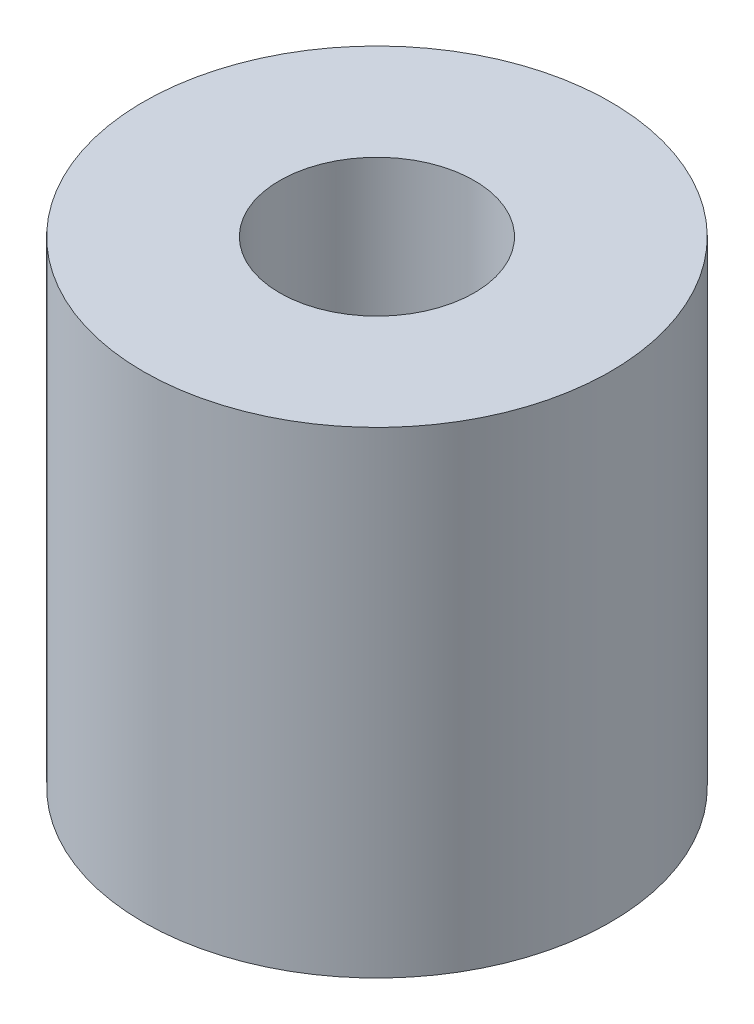
ISO-10303-21;
HEADER;
FILE_DESCRIPTION(('STEP AP214'),'2;1');
FILE_NAME('part.step','',(''),(''),'','','');
FILE_SCHEMA(('AUTOMOTIVE_DESIGN { 1 0 10303 214 1 1 1 1 }'));
ENDSEC;
DATA;
#1=APPLICATION_CONTEXT('core data for automotive mechanical design processes');
#2=APPLICATION_PROTOCOL_DEFINITION('international standard','automotive_design',2000,#1);
#3=PRODUCT_CONTEXT('',#1,'mechanical');
#4=PRODUCT('Part','Part','',(#3));
#5=PRODUCT_RELATED_PRODUCT_CATEGORY('part','',(#4));
#6=PRODUCT_DEFINITION_FORMATION('','',#4);
#7=PRODUCT_DEFINITION_CONTEXT('part definition',#1,'design');
#8=PRODUCT_DEFINITION('design','',#6,#7);
#9=PRODUCT_DEFINITION_SHAPE('','',#8);
#10=(LENGTH_UNIT() NAMED_UNIT(*) SI_UNIT(.MILLI.,.METRE.));
#11=(NAMED_UNIT(*) PLANE_ANGLE_UNIT() SI_UNIT($,.RADIAN.));
#12=(NAMED_UNIT(*) SI_UNIT($,.STERADIAN.) SOLID_ANGLE_UNIT());
#13=UNCERTAINTY_MEASURE_WITH_UNIT(LENGTH_MEASURE(1.E-05),#10,'distance_accuracy_value','');
#14=(GEOMETRIC_REPRESENTATION_CONTEXT(3) GLOBAL_UNCERTAINTY_ASSIGNED_CONTEXT((#13)) GLOBAL_UNIT_ASSIGNED_CONTEXT((#10,
#11,#12)) REPRESENTATION_CONTEXT('',''));
#15=CARTESIAN_POINT('',(0.,0.,0.));
#16=DIRECTION('',(0.,0.,1.));
#17=DIRECTION('',(1.,0.,0.));
#18=AXIS2_PLACEMENT_3D('',#15,#16,#17);
#19=CARTESIAN_POINT('',(0.,98.,0.));
#20=DIRECTION('',(0.,1.,0.));
#21=DIRECTION('',(0.,0.,1.));
#22=AXIS2_PLACEMENT_3D('',#19,#20,#21);
#23=PLANE('',#22);
#24=CARTESIAN_POINT('',(0.,98.,0.));
#25=DIRECTION('',(0.,1.,0.));
#26=DIRECTION('',(0.,0.,1.));
#27=AXIS2_PLACEMENT_3D('',#24,#25,#26);
#28=CIRCLE('',#27,48.);
#29=CARTESIAN_POINT('',(0.,98.,48.));
#30=VERTEX_POINT('',#29);
#31=EDGE_CURVE('E10',#30,#30,#28,.T.);
#32=ORIENTED_EDGE('',*,*,#31,.T.);
#33=EDGE_LOOP('',(#32));
#34=FACE_BOUND('',#33,.T.);
#35=CARTESIAN_POINT('',(0.,98.,0.));
#36=DIRECTION('',(0.,1.,0.));
#37=DIRECTION('',(0.,0.,1.));
#38=AXIS2_PLACEMENT_3D('',#35,#36,#37);
#39=CIRCLE('',#38,20.);
#40=CARTESIAN_POINT('',(0.,98.,20.));
#41=VERTEX_POINT('',#40);
#42=EDGE_CURVE('E42',#41,#41,#39,.T.);
#43=ORIENTED_EDGE('',*,*,#42,.F.);
#44=EDGE_LOOP('',(#43));
#45=FACE_BOUND('',#44,.T.);
#46=ADVANCED_FACE('F31',(#34,#45),#23,.T.);
#47=CARTESIAN_POINT('',(0.,0.,0.));
#48=DIRECTION('',(0.,1.,0.));
#49=DIRECTION('',(0.,0.,1.));
#50=AXIS2_PLACEMENT_3D('',#47,#48,#49);
#51=PLANE('',#50);
#52=CARTESIAN_POINT('',(0.,0.,0.));
#53=DIRECTION('',(0.,1.,0.));
#54=DIRECTION('',(0.,0.,1.));
#55=AXIS2_PLACEMENT_3D('',#52,#53,#54);
#56=CIRCLE('',#55,48.);
#57=CARTESIAN_POINT('',(0.,0.,48.));
#58=VERTEX_POINT('',#57);
#59=EDGE_CURVE('E35',#58,#58,#56,.T.);
#60=ORIENTED_EDGE('',*,*,#59,.F.);
#61=EDGE_LOOP('',(#60));
#62=FACE_BOUND('',#61,.T.);
#63=CARTESIAN_POINT('',(0.,0.,0.));
#64=DIRECTION('',(0.,1.,0.));
#65=DIRECTION('',(0.,0.,1.));
#66=AXIS2_PLACEMENT_3D('',#63,#64,#65);
#67=CIRCLE('',#66,20.);
#68=CARTESIAN_POINT('',(0.,0.,20.));
#69=VERTEX_POINT('',#68);
#70=EDGE_CURVE('E44',#69,#69,#67,.T.);
#71=ORIENTED_EDGE('',*,*,#70,.T.);
#72=EDGE_LOOP('',(#71));
#73=FACE_BOUND('',#72,.T.);
#74=ADVANCED_FACE('F54',(#62,#73),#51,.F.);
#75=CARTESIAN_POINT('',(0.,98.,0.));
#76=DIRECTION('',(0.,-1.,0.));
#77=DIRECTION('',(0.,0.,-1.));
#78=AXIS2_PLACEMENT_3D('',#75,#76,#77);
#79=CYLINDRICAL_SURFACE('',#78,48.);
#80=ORIENTED_EDGE('',*,*,#31,.F.);
#81=EDGE_LOOP('',(#80));
#82=FACE_BOUND('',#81,.T.);
#83=ORIENTED_EDGE('',*,*,#59,.T.);
#84=EDGE_LOOP('',(#83));
#85=FACE_BOUND('',#84,.T.);
#86=ADVANCED_FACE('F33',(#82,#85),#79,.T.);
#87=CARTESIAN_POINT('',(0.,98.,0.));
#88=DIRECTION('',(0.,-1.,0.));
#89=DIRECTION('',(0.,0.,-1.));
#90=AXIS2_PLACEMENT_3D('',#87,#88,#89);
#91=CYLINDRICAL_SURFACE('',#90,20.);
#92=ORIENTED_EDGE('',*,*,#42,.T.);
#93=EDGE_LOOP('',(#92));
#94=FACE_BOUND('',#93,.T.);
#95=ORIENTED_EDGE('',*,*,#70,.F.);
#96=EDGE_LOOP('',(#95));
#97=FACE_BOUND('',#96,.T.);
#98=ADVANCED_FACE('F50',(#94,#97),#91,.F.);
#99=CLOSED_SHELL('',(#46,#74,#86,#98));
#100=MANIFOLD_SOLID_BREP('B2',#99);
#101=ADVANCED_BREP_SHAPE_REPRESENTATION('',(#18,#100),#14);
#102=SHAPE_DEFINITION_REPRESENTATION(#9,#101);
ENDSEC;
END-ISO-10303-21;
